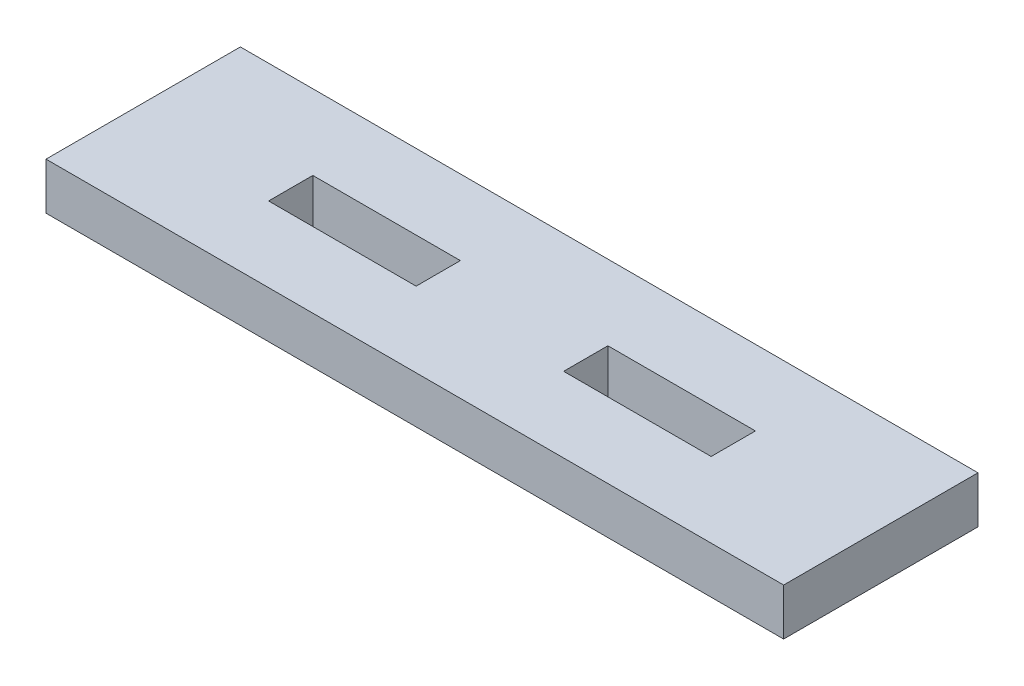
ISO-10303-21;
HEADER;
FILE_DESCRIPTION(('STEP AP214'),'2;1');
FILE_NAME('part.step','',(''),(''),'','','');
FILE_SCHEMA(('AUTOMOTIVE_DESIGN { 1 0 10303 214 1 1 1 1 }'));
ENDSEC;
DATA;
#1=APPLICATION_CONTEXT('core data for automotive mechanical design processes');
#2=APPLICATION_PROTOCOL_DEFINITION('international standard','automotive_design',2000,#1);
#3=PRODUCT_CONTEXT('',#1,'mechanical');
#4=PRODUCT('Part','Part','',(#3));
#5=PRODUCT_RELATED_PRODUCT_CATEGORY('part','',(#4));
#6=PRODUCT_DEFINITION_FORMATION('','',#4);
#7=PRODUCT_DEFINITION_CONTEXT('part definition',#1,'design');
#8=PRODUCT_DEFINITION('design','',#6,#7);
#9=PRODUCT_DEFINITION_SHAPE('','',#8);
#10=(LENGTH_UNIT() NAMED_UNIT(*) SI_UNIT(.MILLI.,.METRE.));
#11=(NAMED_UNIT(*) PLANE_ANGLE_UNIT() SI_UNIT($,.RADIAN.));
#12=(NAMED_UNIT(*) SI_UNIT($,.STERADIAN.) SOLID_ANGLE_UNIT());
#13=UNCERTAINTY_MEASURE_WITH_UNIT(LENGTH_MEASURE(1.E-05),#10,'distance_accuracy_value','');
#14=(GEOMETRIC_REPRESENTATION_CONTEXT(3) GLOBAL_UNCERTAINTY_ASSIGNED_CONTEXT((#13)) GLOBAL_UNIT_ASSIGNED_CONTEXT((#10,
#11,#12)) REPRESENTATION_CONTEXT('',''));
#15=CARTESIAN_POINT('',(0.,0.,0.));
#16=DIRECTION('',(0.,0.,1.));
#17=DIRECTION('',(1.,0.,0.));
#18=AXIS2_PLACEMENT_3D('',#15,#16,#17);
#19=CARTESIAN_POINT('',(0.,3.175,0.));
#20=DIRECTION('',(0.,-1.,0.));
#21=DIRECTION('',(0.,0.,-1.));
#22=AXIS2_PLACEMENT_3D('',#19,#20,#21);
#23=PLANE('',#22);
#24=DIRECTION('',(0.,0.,-1.));
#25=VECTOR('',#24,1.);
#26=CARTESIAN_POINT('',(20.,3.175,-5.0875));
#27=LINE('',#26,#25);
#28=CARTESIAN_POINT('',(20.,3.175,-5.0875));
#29=VERTEX_POINT('',#28);
#30=CARTESIAN_POINT('',(20.,3.175,-8.0875));
#31=VERTEX_POINT('',#30);
#32=EDGE_CURVE('E158',#29,#31,#27,.T.);
#33=ORIENTED_EDGE('',*,*,#32,.F.);
#34=DIRECTION('',(1.,0.,0.));
#35=VECTOR('',#34,1.);
#36=CARTESIAN_POINT('',(10.,3.175,-5.0875));
#37=LINE('',#36,#35);
#38=CARTESIAN_POINT('',(10.,3.175,-5.0875));
#39=VERTEX_POINT('',#38);
#40=EDGE_CURVE('E166',#39,#29,#37,.T.);
#41=ORIENTED_EDGE('',*,*,#40,.F.);
#42=DIRECTION('',(0.,0.,1.));
#43=VECTOR('',#42,1.);
#44=CARTESIAN_POINT('',(10.,3.175,-5.0875));
#45=LINE('',#44,#43);
#46=CARTESIAN_POINT('',(10.,3.175,-8.0875));
#47=VERTEX_POINT('',#46);
#48=EDGE_CURVE('E163',#47,#39,#45,.T.);
#49=ORIENTED_EDGE('',*,*,#48,.F.);
#50=DIRECTION('',(-1.,0.,0.));
#51=VECTOR('',#50,1.);
#52=CARTESIAN_POINT('',(10.,3.175,-8.0875));
#53=LINE('',#52,#51);
#54=EDGE_CURVE('E160',#31,#47,#53,.T.);
#55=ORIENTED_EDGE('',*,*,#54,.F.);
#56=EDGE_LOOP('',(#33,#41,#49,#55));
#57=FACE_BOUND('',#56,.T.);
#58=DIRECTION('',(0.,0.,1.));
#59=VECTOR('',#58,1.);
#60=CARTESIAN_POINT('',(0.,3.175,0.));
#61=LINE('',#60,#59);
#62=CARTESIAN_POINT('',(0.,3.175,-13.175));
#63=VERTEX_POINT('',#62);
#64=CARTESIAN_POINT('',(0.,3.175,0.));
#65=VERTEX_POINT('',#64);
#66=EDGE_CURVE('E189',#63,#65,#61,.T.);
#67=ORIENTED_EDGE('',*,*,#66,.T.);
#68=DIRECTION('',(1.,0.,0.));
#69=VECTOR('',#68,1.);
#70=CARTESIAN_POINT('',(0.,3.175,0.));
#71=LINE('',#70,#69);
#72=CARTESIAN_POINT('',(50.,3.175,0.));
#73=VERTEX_POINT('',#72);
#74=EDGE_CURVE('E192',#65,#73,#71,.T.);
#75=ORIENTED_EDGE('',*,*,#74,.T.);
#76=DIRECTION('',(0.,0.,-1.));
#77=VECTOR('',#76,1.);
#78=CARTESIAN_POINT('',(50.,3.175,0.));
#79=LINE('',#78,#77);
#80=CARTESIAN_POINT('',(50.,3.175,-13.175));
#81=VERTEX_POINT('',#80);
#82=EDGE_CURVE('E195',#73,#81,#79,.T.);
#83=ORIENTED_EDGE('',*,*,#82,.T.);
#84=DIRECTION('',(-1.,0.,0.));
#85=VECTOR('',#84,1.);
#86=CARTESIAN_POINT('',(0.,3.175,-13.175));
#87=LINE('',#86,#85);
#88=EDGE_CURVE('E197',#81,#63,#87,.T.);
#89=ORIENTED_EDGE('',*,*,#88,.T.);
#90=EDGE_LOOP('',(#67,#75,#83,#89));
#91=FACE_BOUND('',#90,.T.);
#92=DIRECTION('',(0.,0.,-1.));
#93=VECTOR('',#92,1.);
#94=CARTESIAN_POINT('',(40.,3.175,-5.0875));
#95=LINE('',#94,#93);
#96=CARTESIAN_POINT('',(40.,3.175,-5.0875));
#97=VERTEX_POINT('',#96);
#98=CARTESIAN_POINT('',(40.,3.175,-8.0875));
#99=VERTEX_POINT('',#98);
#100=EDGE_CURVE('E122',#97,#99,#95,.T.);
#101=ORIENTED_EDGE('',*,*,#100,.F.);
#102=DIRECTION('',(1.,0.,0.));
#103=VECTOR('',#102,1.);
#104=CARTESIAN_POINT('',(30.,3.175,-5.0875));
#105=LINE('',#104,#103);
#106=CARTESIAN_POINT('',(30.,3.175,-5.0875));
#107=VERTEX_POINT('',#106);
#108=EDGE_CURVE('E144',#107,#97,#105,.T.);
#109=ORIENTED_EDGE('',*,*,#108,.F.);
#110=DIRECTION('',(0.,0.,1.));
#111=VECTOR('',#110,1.);
#112=CARTESIAN_POINT('',(30.,3.175,-5.0875));
#113=LINE('',#112,#111);
#114=CARTESIAN_POINT('',(30.,3.175,-8.0875));
#115=VERTEX_POINT('',#114);
#116=EDGE_CURVE('E142',#115,#107,#113,.T.);
#117=ORIENTED_EDGE('',*,*,#116,.F.);
#118=DIRECTION('',(-1.,0.,0.));
#119=VECTOR('',#118,1.);
#120=CARTESIAN_POINT('',(30.,3.175,-8.0875));
#121=LINE('',#120,#119);
#122=EDGE_CURVE('E130',#99,#115,#121,.T.);
#123=ORIENTED_EDGE('',*,*,#122,.F.);
#124=EDGE_LOOP('',(#101,#109,#117,#123));
#125=FACE_BOUND('',#124,.T.);
#126=ADVANCED_FACE('F33',(#57,#91,#125),#23,.F.);
#127=CARTESIAN_POINT('',(0.,0.,0.));
#128=DIRECTION('',(0.,-1.,0.));
#129=DIRECTION('',(0.,0.,-1.));
#130=AXIS2_PLACEMENT_3D('',#127,#128,#129);
#131=PLANE('',#130);
#132=DIRECTION('',(0.,0.,1.));
#133=VECTOR('',#132,1.);
#134=CARTESIAN_POINT('',(0.,0.,0.));
#135=LINE('',#134,#133);
#136=CARTESIAN_POINT('',(0.,0.,-13.175));
#137=VERTEX_POINT('',#136);
#138=CARTESIAN_POINT('',(0.,0.,0.));
#139=VERTEX_POINT('',#138);
#140=EDGE_CURVE('E188',#137,#139,#135,.T.);
#141=ORIENTED_EDGE('',*,*,#140,.F.);
#142=DIRECTION('',(-1.,0.,0.));
#143=VECTOR('',#142,1.);
#144=CARTESIAN_POINT('',(0.,0.,-13.175));
#145=LINE('',#144,#143);
#146=CARTESIAN_POINT('',(50.,0.,-13.175));
#147=VERTEX_POINT('',#146);
#148=EDGE_CURVE('E193',#147,#137,#145,.T.);
#149=ORIENTED_EDGE('',*,*,#148,.F.);
#150=DIRECTION('',(0.,0.,-1.));
#151=VECTOR('',#150,1.);
#152=CARTESIAN_POINT('',(50.,0.,0.));
#153=LINE('',#152,#151);
#154=CARTESIAN_POINT('',(50.,0.,0.));
#155=VERTEX_POINT('',#154);
#156=EDGE_CURVE('E204',#155,#147,#153,.T.);
#157=ORIENTED_EDGE('',*,*,#156,.F.);
#158=DIRECTION('',(1.,0.,0.));
#159=VECTOR('',#158,1.);
#160=CARTESIAN_POINT('',(0.,0.,0.));
#161=LINE('',#160,#159);
#162=EDGE_CURVE('E202',#139,#155,#161,.T.);
#163=ORIENTED_EDGE('',*,*,#162,.F.);
#164=EDGE_LOOP('',(#141,#149,#157,#163));
#165=FACE_BOUND('',#164,.T.);
#166=DIRECTION('',(1.,0.,0.));
#167=VECTOR('',#166,1.);
#168=CARTESIAN_POINT('',(10.,0.,-5.0875));
#169=LINE('',#168,#167);
#170=CARTESIAN_POINT('',(10.,0.,-5.0875));
#171=VERTEX_POINT('',#170);
#172=CARTESIAN_POINT('',(20.,0.,-5.0875));
#173=VERTEX_POINT('',#172);
#174=EDGE_CURVE('E161',#171,#173,#169,.T.);
#175=ORIENTED_EDGE('',*,*,#174,.T.);
#176=DIRECTION('',(0.,0.,-1.));
#177=VECTOR('',#176,1.);
#178=CARTESIAN_POINT('',(20.,0.,-5.0875));
#179=LINE('',#178,#177);
#180=CARTESIAN_POINT('',(20.,0.,-8.0875));
#181=VERTEX_POINT('',#180);
#182=EDGE_CURVE('E138',#173,#181,#179,.T.);
#183=ORIENTED_EDGE('',*,*,#182,.T.);
#184=DIRECTION('',(-1.,0.,0.));
#185=VECTOR('',#184,1.);
#186=CARTESIAN_POINT('',(10.,0.,-8.0875));
#187=LINE('',#186,#185);
#188=CARTESIAN_POINT('',(10.,0.,-8.0875));
#189=VERTEX_POINT('',#188);
#190=EDGE_CURVE('E171',#181,#189,#187,.T.);
#191=ORIENTED_EDGE('',*,*,#190,.T.);
#192=DIRECTION('',(0.,0.,1.));
#193=VECTOR('',#192,1.);
#194=CARTESIAN_POINT('',(10.,0.,-5.0875));
#195=LINE('',#194,#193);
#196=EDGE_CURVE('E174',#189,#171,#195,.T.);
#197=ORIENTED_EDGE('',*,*,#196,.T.);
#198=EDGE_LOOP('',(#175,#183,#191,#197));
#199=FACE_BOUND('',#198,.T.);
#200=DIRECTION('',(1.,0.,0.));
#201=VECTOR('',#200,1.);
#202=CARTESIAN_POINT('',(30.,0.,-5.0875));
#203=LINE('',#202,#201);
#204=CARTESIAN_POINT('',(30.,0.,-5.0875));
#205=VERTEX_POINT('',#204);
#206=CARTESIAN_POINT('',(40.,0.,-5.0875));
#207=VERTEX_POINT('',#206);
#208=EDGE_CURVE('E131',#205,#207,#203,.T.);
#209=ORIENTED_EDGE('',*,*,#208,.T.);
#210=DIRECTION('',(0.,0.,-1.));
#211=VECTOR('',#210,1.);
#212=CARTESIAN_POINT('',(40.,0.,-5.0875));
#213=LINE('',#212,#211);
#214=CARTESIAN_POINT('',(40.,0.,-8.0875));
#215=VERTEX_POINT('',#214);
#216=EDGE_CURVE('E56',#207,#215,#213,.T.);
#217=ORIENTED_EDGE('',*,*,#216,.T.);
#218=DIRECTION('',(-1.,0.,0.));
#219=VECTOR('',#218,1.);
#220=CARTESIAN_POINT('',(30.,0.,-8.0875));
#221=LINE('',#220,#219);
#222=CARTESIAN_POINT('',(30.,0.,-8.0875));
#223=VERTEX_POINT('',#222);
#224=EDGE_CURVE('E137',#215,#223,#221,.T.);
#225=ORIENTED_EDGE('',*,*,#224,.T.);
#226=DIRECTION('',(0.,0.,1.));
#227=VECTOR('',#226,1.);
#228=CARTESIAN_POINT('',(30.,0.,-5.0875));
#229=LINE('',#228,#227);
#230=EDGE_CURVE('E150',#223,#205,#229,.T.);
#231=ORIENTED_EDGE('',*,*,#230,.T.);
#232=EDGE_LOOP('',(#209,#217,#225,#231));
#233=FACE_BOUND('',#232,.T.);
#234=ADVANCED_FACE('F222',(#165,#199,#233),#131,.T.);
#235=CARTESIAN_POINT('',(0.,3.175,0.));
#236=DIRECTION('',(1.,0.,0.));
#237=DIRECTION('',(0.,0.,-1.));
#238=AXIS2_PLACEMENT_3D('',#235,#236,#237);
#239=PLANE('',#238);
#240=ORIENTED_EDGE('',*,*,#140,.T.);
#241=DIRECTION('',(0.,-1.,0.));
#242=VECTOR('',#241,1.);
#243=CARTESIAN_POINT('',(0.,3.175,0.));
#244=LINE('',#243,#242);
#245=EDGE_CURVE('E11',#65,#139,#244,.T.);
#246=ORIENTED_EDGE('',*,*,#245,.F.);
#247=ORIENTED_EDGE('',*,*,#66,.F.);
#248=DIRECTION('',(0.,-1.,0.));
#249=VECTOR('',#248,1.);
#250=CARTESIAN_POINT('',(0.,3.175,-13.175));
#251=LINE('',#250,#249);
#252=EDGE_CURVE('E199',#63,#137,#251,.T.);
#253=ORIENTED_EDGE('',*,*,#252,.T.);
#254=EDGE_LOOP('',(#240,#246,#247,#253));
#255=FACE_BOUND('',#254,.T.);
#256=ADVANCED_FACE('F35',(#255),#239,.F.);
#257=CARTESIAN_POINT('',(0.,3.175,0.));
#258=DIRECTION('',(0.,0.,-1.));
#259=DIRECTION('',(-1.,0.,0.));
#260=AXIS2_PLACEMENT_3D('',#257,#258,#259);
#261=PLANE('',#260);
#262=ORIENTED_EDGE('',*,*,#162,.T.);
#263=DIRECTION('',(0.,-1.,0.));
#264=VECTOR('',#263,1.);
#265=CARTESIAN_POINT('',(50.,3.175,0.));
#266=LINE('',#265,#264);
#267=EDGE_CURVE('E41',#73,#155,#266,.T.);
#268=ORIENTED_EDGE('',*,*,#267,.F.);
#269=ORIENTED_EDGE('',*,*,#74,.F.);
#270=ORIENTED_EDGE('',*,*,#245,.T.);
#271=EDGE_LOOP('',(#262,#268,#269,#270));
#272=FACE_BOUND('',#271,.T.);
#273=ADVANCED_FACE('F232',(#272),#261,.F.);
#274=CARTESIAN_POINT('',(50.,3.175,0.));
#275=DIRECTION('',(-1.,0.,0.));
#276=DIRECTION('',(0.,0.,1.));
#277=AXIS2_PLACEMENT_3D('',#274,#275,#276);
#278=PLANE('',#277);
#279=ORIENTED_EDGE('',*,*,#156,.T.);
#280=DIRECTION('',(0.,-1.,0.));
#281=VECTOR('',#280,1.);
#282=CARTESIAN_POINT('',(50.,3.175,-13.175));
#283=LINE('',#282,#281);
#284=EDGE_CURVE('E209',#81,#147,#283,.T.);
#285=ORIENTED_EDGE('',*,*,#284,.F.);
#286=ORIENTED_EDGE('',*,*,#82,.F.);
#287=ORIENTED_EDGE('',*,*,#267,.T.);
#288=EDGE_LOOP('',(#279,#285,#286,#287));
#289=FACE_BOUND('',#288,.T.);
#290=ADVANCED_FACE('F216',(#289),#278,.F.);
#291=CARTESIAN_POINT('',(0.,3.175,-13.175));
#292=DIRECTION('',(0.,0.,1.));
#293=DIRECTION('',(1.,0.,0.));
#294=AXIS2_PLACEMENT_3D('',#291,#292,#293);
#295=PLANE('',#294);
#296=ORIENTED_EDGE('',*,*,#148,.T.);
#297=ORIENTED_EDGE('',*,*,#252,.F.);
#298=ORIENTED_EDGE('',*,*,#88,.F.);
#299=ORIENTED_EDGE('',*,*,#284,.T.);
#300=EDGE_LOOP('',(#296,#297,#298,#299));
#301=FACE_BOUND('',#300,.T.);
#302=ADVANCED_FACE('F226',(#301),#295,.F.);
#303=CARTESIAN_POINT('',(20.,3.175,-5.0875));
#304=DIRECTION('',(-1.,0.,0.));
#305=DIRECTION('',(0.,0.,1.));
#306=AXIS2_PLACEMENT_3D('',#303,#304,#305);
#307=PLANE('',#306);
#308=ORIENTED_EDGE('',*,*,#182,.F.);
#309=DIRECTION('',(0.,-1.,0.));
#310=VECTOR('',#309,1.);
#311=CARTESIAN_POINT('',(20.,3.175,-5.0875));
#312=LINE('',#311,#310);
#313=EDGE_CURVE('E168',#29,#173,#312,.T.);
#314=ORIENTED_EDGE('',*,*,#313,.F.);
#315=ORIENTED_EDGE('',*,*,#32,.T.);
#316=DIRECTION('',(0.,-1.,0.));
#317=VECTOR('',#316,1.);
#318=CARTESIAN_POINT('',(20.,3.175,-8.0875));
#319=LINE('',#318,#317);
#320=EDGE_CURVE('E185',#31,#181,#319,.T.);
#321=ORIENTED_EDGE('',*,*,#320,.T.);
#322=EDGE_LOOP('',(#308,#314,#315,#321));
#323=FACE_BOUND('',#322,.T.);
#324=ADVANCED_FACE('F248',(#323),#307,.T.);
#325=CARTESIAN_POINT('',(10.,3.175,-8.0875));
#326=DIRECTION('',(0.,0.,1.));
#327=DIRECTION('',(1.,0.,0.));
#328=AXIS2_PLACEMENT_3D('',#325,#326,#327);
#329=PLANE('',#328);
#330=ORIENTED_EDGE('',*,*,#190,.F.);
#331=ORIENTED_EDGE('',*,*,#320,.F.);
#332=ORIENTED_EDGE('',*,*,#54,.T.);
#333=DIRECTION('',(0.,-1.,0.));
#334=VECTOR('',#333,1.);
#335=CARTESIAN_POINT('',(10.,3.175,-8.0875));
#336=LINE('',#335,#334);
#337=EDGE_CURVE('E183',#47,#189,#336,.T.);
#338=ORIENTED_EDGE('',*,*,#337,.T.);
#339=EDGE_LOOP('',(#330,#331,#332,#338));
#340=FACE_BOUND('',#339,.T.);
#341=ADVANCED_FACE('F255',(#340),#329,.T.);
#342=CARTESIAN_POINT('',(10.,3.175,-5.0875));
#343=DIRECTION('',(1.,0.,0.));
#344=DIRECTION('',(0.,0.,-1.));
#345=AXIS2_PLACEMENT_3D('',#342,#343,#344);
#346=PLANE('',#345);
#347=ORIENTED_EDGE('',*,*,#196,.F.);
#348=ORIENTED_EDGE('',*,*,#337,.F.);
#349=ORIENTED_EDGE('',*,*,#48,.T.);
#350=DIRECTION('',(0.,-1.,0.));
#351=VECTOR('',#350,1.);
#352=CARTESIAN_POINT('',(10.,3.175,-5.0875));
#353=LINE('',#352,#351);
#354=EDGE_CURVE('E181',#39,#171,#353,.T.);
#355=ORIENTED_EDGE('',*,*,#354,.T.);
#356=EDGE_LOOP('',(#347,#348,#349,#355));
#357=FACE_BOUND('',#356,.T.);
#358=ADVANCED_FACE('F260',(#357),#346,.T.);
#359=CARTESIAN_POINT('',(10.,3.175,-5.0875));
#360=DIRECTION('',(0.,0.,-1.));
#361=DIRECTION('',(-1.,0.,0.));
#362=AXIS2_PLACEMENT_3D('',#359,#360,#361);
#363=PLANE('',#362);
#364=ORIENTED_EDGE('',*,*,#174,.F.);
#365=ORIENTED_EDGE('',*,*,#354,.F.);
#366=ORIENTED_EDGE('',*,*,#40,.T.);
#367=ORIENTED_EDGE('',*,*,#313,.T.);
#368=EDGE_LOOP('',(#364,#365,#366,#367));
#369=FACE_BOUND('',#368,.T.);
#370=ADVANCED_FACE('F266',(#369),#363,.T.);
#371=CARTESIAN_POINT('',(40.,3.175,-5.0875));
#372=DIRECTION('',(-1.,0.,0.));
#373=DIRECTION('',(0.,0.,1.));
#374=AXIS2_PLACEMENT_3D('',#371,#372,#373);
#375=PLANE('',#374);
#376=ORIENTED_EDGE('',*,*,#216,.F.);
#377=DIRECTION('',(0.,-1.,0.));
#378=VECTOR('',#377,1.);
#379=CARTESIAN_POINT('',(40.,3.175,-5.0875));
#380=LINE('',#379,#378);
#381=EDGE_CURVE('E126',#97,#207,#380,.T.);
#382=ORIENTED_EDGE('',*,*,#381,.F.);
#383=ORIENTED_EDGE('',*,*,#100,.T.);
#384=DIRECTION('',(0.,-1.,0.));
#385=VECTOR('',#384,1.);
#386=CARTESIAN_POINT('',(40.,3.175,-8.0875));
#387=LINE('',#386,#385);
#388=EDGE_CURVE('E125',#99,#215,#387,.T.);
#389=ORIENTED_EDGE('',*,*,#388,.T.);
#390=EDGE_LOOP('',(#376,#382,#383,#389));
#391=FACE_BOUND('',#390,.T.);
#392=ADVANCED_FACE('F124',(#391),#375,.T.);
#393=CARTESIAN_POINT('',(30.,3.175,-8.0875));
#394=DIRECTION('',(0.,0.,1.));
#395=DIRECTION('',(1.,0.,0.));
#396=AXIS2_PLACEMENT_3D('',#393,#394,#395);
#397=PLANE('',#396);
#398=ORIENTED_EDGE('',*,*,#224,.F.);
#399=ORIENTED_EDGE('',*,*,#388,.F.);
#400=ORIENTED_EDGE('',*,*,#122,.T.);
#401=DIRECTION('',(0.,-1.,0.));
#402=VECTOR('',#401,1.);
#403=CARTESIAN_POINT('',(30.,3.175,-8.0875));
#404=LINE('',#403,#402);
#405=EDGE_CURVE('E139',#115,#223,#404,.T.);
#406=ORIENTED_EDGE('',*,*,#405,.T.);
#407=EDGE_LOOP('',(#398,#399,#400,#406));
#408=FACE_BOUND('',#407,.T.);
#409=ADVANCED_FACE('F134',(#408),#397,.T.);
#410=CARTESIAN_POINT('',(30.,3.175,-5.0875));
#411=DIRECTION('',(1.,0.,0.));
#412=DIRECTION('',(0.,0.,-1.));
#413=AXIS2_PLACEMENT_3D('',#410,#411,#412);
#414=PLANE('',#413);
#415=ORIENTED_EDGE('',*,*,#230,.F.);
#416=ORIENTED_EDGE('',*,*,#405,.F.);
#417=ORIENTED_EDGE('',*,*,#116,.T.);
#418=DIRECTION('',(0.,-1.,0.));
#419=VECTOR('',#418,1.);
#420=CARTESIAN_POINT('',(30.,3.175,-5.0875));
#421=LINE('',#420,#419);
#422=EDGE_CURVE('E48',#107,#205,#421,.T.);
#423=ORIENTED_EDGE('',*,*,#422,.T.);
#424=EDGE_LOOP('',(#415,#416,#417,#423));
#425=FACE_BOUND('',#424,.T.);
#426=ADVANCED_FACE('F285',(#425),#414,.T.);
#427=CARTESIAN_POINT('',(30.,3.175,-5.0875));
#428=DIRECTION('',(0.,0.,-1.));
#429=DIRECTION('',(-1.,0.,0.));
#430=AXIS2_PLACEMENT_3D('',#427,#428,#429);
#431=PLANE('',#430);
#432=ORIENTED_EDGE('',*,*,#208,.F.);
#433=ORIENTED_EDGE('',*,*,#422,.F.);
#434=ORIENTED_EDGE('',*,*,#108,.T.);
#435=ORIENTED_EDGE('',*,*,#381,.T.);
#436=EDGE_LOOP('',(#432,#433,#434,#435));
#437=FACE_BOUND('',#436,.T.);
#438=ADVANCED_FACE('F288',(#437),#431,.T.);
#439=CLOSED_SHELL('',(#126,#234,#256,#273,#290,#302,#324,#341,#358,#370,#392,#409,#426,#438));
#440=MANIFOLD_SOLID_BREP('B2',#439);
#441=ADVANCED_BREP_SHAPE_REPRESENTATION('',(#18,#440),#14);
#442=SHAPE_DEFINITION_REPRESENTATION(#9,#441);
ENDSEC;
END-ISO-10303-21;
